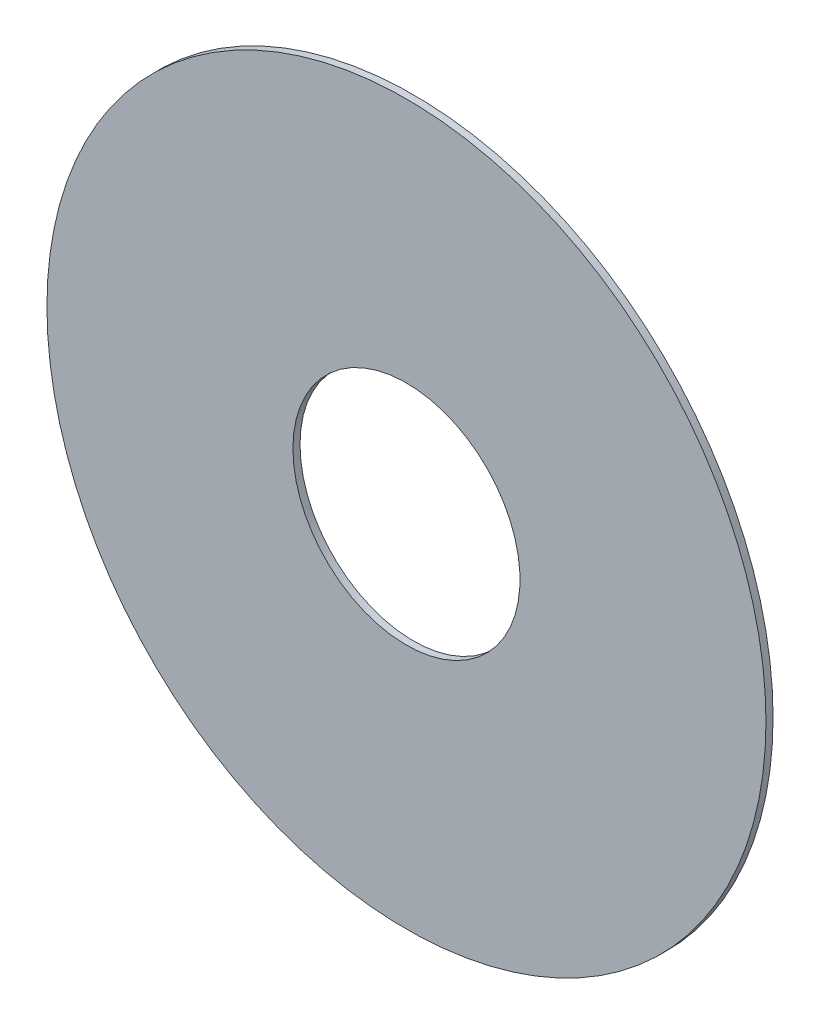
ISO-10303-21;
HEADER;
FILE_DESCRIPTION(('STEP AP214'),'2;1');
FILE_NAME('part.step','',(''),(''),'','','');
FILE_SCHEMA(('AUTOMOTIVE_DESIGN { 1 0 10303 214 1 1 1 1 }'));
ENDSEC;
DATA;
#1=APPLICATION_CONTEXT('core data for automotive mechanical design processes');
#2=APPLICATION_PROTOCOL_DEFINITION('international standard','automotive_design',2000,#1);
#3=PRODUCT_CONTEXT('',#1,'mechanical');
#4=PRODUCT('Part','Part','',(#3));
#5=PRODUCT_RELATED_PRODUCT_CATEGORY('part','',(#4));
#6=PRODUCT_DEFINITION_FORMATION('','',#4);
#7=PRODUCT_DEFINITION_CONTEXT('part definition',#1,'design');
#8=PRODUCT_DEFINITION('design','',#6,#7);
#9=PRODUCT_DEFINITION_SHAPE('','',#8);
#10=(LENGTH_UNIT() NAMED_UNIT(*) SI_UNIT(.MILLI.,.METRE.));
#11=(NAMED_UNIT(*) PLANE_ANGLE_UNIT() SI_UNIT($,.RADIAN.));
#12=(NAMED_UNIT(*) SI_UNIT($,.STERADIAN.) SOLID_ANGLE_UNIT());
#13=UNCERTAINTY_MEASURE_WITH_UNIT(LENGTH_MEASURE(1.E-05),#10,'distance_accuracy_value','');
#14=(GEOMETRIC_REPRESENTATION_CONTEXT(3) GLOBAL_UNCERTAINTY_ASSIGNED_CONTEXT((#13)) GLOBAL_UNIT_ASSIGNED_CONTEXT((#10,
#11,#12)) REPRESENTATION_CONTEXT('',''));
#15=CARTESIAN_POINT('',(0.,0.,0.));
#16=DIRECTION('',(0.,0.,1.));
#17=DIRECTION('',(1.,0.,0.));
#18=AXIS2_PLACEMENT_3D('',#15,#16,#17);
#19=CARTESIAN_POINT('',(0.,0.,0.));
#20=DIRECTION('',(0.,0.,1.));
#21=DIRECTION('',(1.,0.,0.));
#22=AXIS2_PLACEMENT_3D('',#19,#20,#21);
#23=PLANE('',#22);
#24=CARTESIAN_POINT('',(0.,0.,0.));
#25=DIRECTION('',(0.,0.,-1.));
#26=DIRECTION('',(-1.,0.,0.));
#27=AXIS2_PLACEMENT_3D('',#24,#25,#26);
#28=CIRCLE('',#27,76.2);
#29=CARTESIAN_POINT('',(-76.2,0.,0.));
#30=VERTEX_POINT('',#29);
#31=EDGE_CURVE('E27',#30,#30,#28,.F.);
#32=ORIENTED_EDGE('',*,*,#31,.T.);
#33=EDGE_LOOP('',(#32));
#34=FACE_BOUND('',#33,.T.);
#35=CARTESIAN_POINT('',(0.,0.,7.45058528761611E-10));
#36=DIRECTION('',(0.,0.,-1.));
#37=DIRECTION('',(-1.,0.,0.));
#38=AXIS2_PLACEMENT_3D('',#35,#36,#37);
#39=CIRCLE('',#38,241.3);
#40=CARTESIAN_POINT('',(-241.3,0.,7.45058528761611E-10));
#41=VERTEX_POINT('',#40);
#42=EDGE_CURVE('E18',#41,#41,#39,.F.);
#43=ORIENTED_EDGE('',*,*,#42,.F.);
#44=EDGE_LOOP('',(#43));
#45=FACE_BOUND('',#44,.T.);
#46=ADVANCED_FACE('F15',(#34,#45),#23,.F.);
#47=CARTESIAN_POINT('',(0.,0.,4.7625));
#48=DIRECTION('',(0.,0.,-1.));
#49=DIRECTION('',(-1.,0.,0.));
#50=AXIS2_PLACEMENT_3D('',#47,#48,#49);
#51=CYLINDRICAL_SURFACE('',#50,241.3);
#52=ORIENTED_EDGE('',*,*,#42,.T.);
#53=EDGE_LOOP('',(#52));
#54=FACE_BOUND('',#53,.T.);
#55=CARTESIAN_POINT('',(0.,0.,4.7625));
#56=DIRECTION('',(0.,0.,-1.));
#57=DIRECTION('',(-1.,0.,0.));
#58=AXIS2_PLACEMENT_3D('',#55,#56,#57);
#59=CIRCLE('',#58,241.3);
#60=CARTESIAN_POINT('',(-241.3,0.,4.7625));
#61=VERTEX_POINT('',#60);
#62=EDGE_CURVE('E22',#61,#61,#59,.F.);
#63=ORIENTED_EDGE('',*,*,#62,.F.);
#64=EDGE_LOOP('',(#63));
#65=FACE_BOUND('',#64,.T.);
#66=ADVANCED_FACE('F35',(#54,#65),#51,.T.);
#67=CARTESIAN_POINT('',(0.,0.,4.7625));
#68=DIRECTION('',(0.,0.,-1.));
#69=DIRECTION('',(-1.,0.,0.));
#70=AXIS2_PLACEMENT_3D('',#67,#68,#69);
#71=CYLINDRICAL_SURFACE('',#70,76.2);
#72=CARTESIAN_POINT('',(0.,0.,4.7625));
#73=DIRECTION('',(0.,0.,-1.));
#74=DIRECTION('',(-1.,0.,0.));
#75=AXIS2_PLACEMENT_3D('',#72,#73,#74);
#76=CIRCLE('',#75,76.2);
#77=CARTESIAN_POINT('',(-76.2,0.,4.7625));
#78=VERTEX_POINT('',#77);
#79=EDGE_CURVE('E10',#78,#78,#76,.T.);
#80=ORIENTED_EDGE('',*,*,#79,.F.);
#81=EDGE_LOOP('',(#80));
#82=FACE_BOUND('',#81,.T.);
#83=ORIENTED_EDGE('',*,*,#31,.F.);
#84=EDGE_LOOP('',(#83));
#85=FACE_BOUND('',#84,.T.);
#86=ADVANCED_FACE('F43',(#82,#85),#71,.F.);
#87=CARTESIAN_POINT('',(0.,0.,4.7625));
#88=DIRECTION('',(0.,0.,1.));
#89=DIRECTION('',(1.,0.,0.));
#90=AXIS2_PLACEMENT_3D('',#87,#88,#89);
#91=PLANE('',#90);
#92=ORIENTED_EDGE('',*,*,#79,.T.);
#93=EDGE_LOOP('',(#92));
#94=FACE_BOUND('',#93,.T.);
#95=ORIENTED_EDGE('',*,*,#62,.T.);
#96=EDGE_LOOP('',(#95));
#97=FACE_BOUND('',#96,.T.);
#98=ADVANCED_FACE('F44',(#94,#97),#91,.T.);
#99=CLOSED_SHELL('',(#46,#66,#86,#98));
#100=MANIFOLD_SOLID_BREP('B1',#99);
#101=ADVANCED_BREP_SHAPE_REPRESENTATION('',(#18,#100),#14);
#102=SHAPE_DEFINITION_REPRESENTATION(#9,#101);
ENDSEC;
END-ISO-10303-21;
